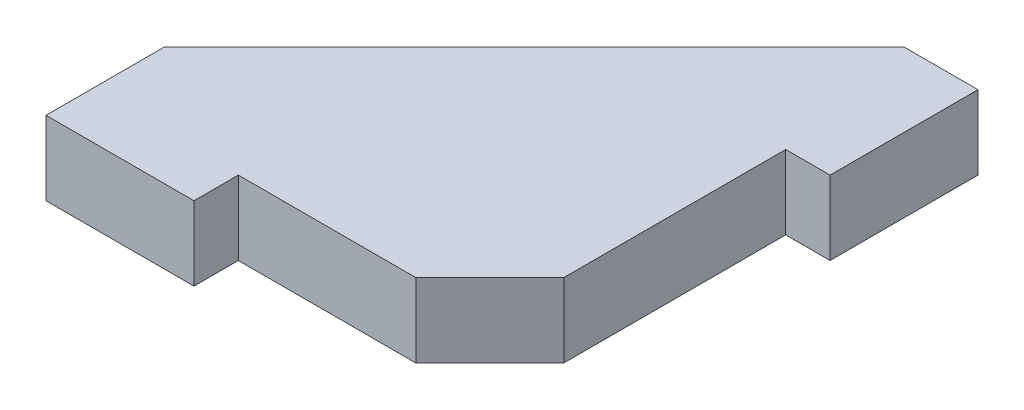
ISO-10303-21;
HEADER;
FILE_DESCRIPTION(('STEP AP214'),'2;1');
FILE_NAME('part.step','',(''),(''),'','','');
FILE_SCHEMA(('AUTOMOTIVE_DESIGN { 1 0 10303 214 1 1 1 1 }'));
ENDSEC;
DATA;
#1=APPLICATION_CONTEXT('core data for automotive mechanical design processes');
#2=APPLICATION_PROTOCOL_DEFINITION('international standard','automotive_design',2000,#1);
#3=PRODUCT_CONTEXT('',#1,'mechanical');
#4=PRODUCT('Part','Part','',(#3));
#5=PRODUCT_RELATED_PRODUCT_CATEGORY('part','',(#4));
#6=PRODUCT_DEFINITION_FORMATION('','',#4);
#7=PRODUCT_DEFINITION_CONTEXT('part definition',#1,'design');
#8=PRODUCT_DEFINITION('design','',#6,#7);
#9=PRODUCT_DEFINITION_SHAPE('','',#8);
#10=(LENGTH_UNIT() NAMED_UNIT(*) SI_UNIT(.MILLI.,.METRE.));
#11=(NAMED_UNIT(*) PLANE_ANGLE_UNIT() SI_UNIT($,.RADIAN.));
#12=(NAMED_UNIT(*) SI_UNIT($,.STERADIAN.) SOLID_ANGLE_UNIT());
#13=UNCERTAINTY_MEASURE_WITH_UNIT(LENGTH_MEASURE(1.E-05),#10,'distance_accuracy_value','');
#14=(GEOMETRIC_REPRESENTATION_CONTEXT(3) GLOBAL_UNCERTAINTY_ASSIGNED_CONTEXT((#13)) GLOBAL_UNIT_ASSIGNED_CONTEXT((#10,
#11,#12)) REPRESENTATION_CONTEXT('',''));
#15=CARTESIAN_POINT('',(0.,0.,0.));
#16=DIRECTION('',(0.,0.,1.));
#17=DIRECTION('',(1.,0.,0.));
#18=AXIS2_PLACEMENT_3D('',#15,#16,#17);
#19=CARTESIAN_POINT('',(10.,5.,0.));
#20=DIRECTION('',(0.,0.,-1.));
#21=DIRECTION('',(-1.,0.,0.));
#22=AXIS2_PLACEMENT_3D('',#19,#20,#21);
#23=PLANE('',#22);
#24=DIRECTION('',(1.,0.,0.));
#25=VECTOR('',#24,1.);
#26=CARTESIAN_POINT('',(10.,0.,0.));
#27=LINE('',#26,#25);
#28=CARTESIAN_POINT('',(0.,0.,0.));
#29=VERTEX_POINT('',#28);
#30=CARTESIAN_POINT('',(10.,0.,0.));
#31=VERTEX_POINT('',#30);
#32=EDGE_CURVE('E140',#29,#31,#27,.T.);
#33=ORIENTED_EDGE('',*,*,#32,.T.);
#34=DIRECTION('',(0.,-1.,0.));
#35=VECTOR('',#34,1.);
#36=CARTESIAN_POINT('',(10.,5.,0.));
#37=LINE('',#36,#35);
#38=CARTESIAN_POINT('',(10.,5.,0.));
#39=VERTEX_POINT('',#38);
#40=EDGE_CURVE('E11',#39,#31,#37,.T.);
#41=ORIENTED_EDGE('',*,*,#40,.F.);
#42=DIRECTION('',(1.,0.,0.));
#43=VECTOR('',#42,1.);
#44=CARTESIAN_POINT('',(10.,5.,0.));
#45=LINE('',#44,#43);
#46=CARTESIAN_POINT('',(0.,5.,0.));
#47=VERTEX_POINT('',#46);
#48=EDGE_CURVE('E158',#47,#39,#45,.T.);
#49=ORIENTED_EDGE('',*,*,#48,.F.);
#50=DIRECTION('',(0.,-1.,0.));
#51=VECTOR('',#50,1.);
#52=CARTESIAN_POINT('',(0.,5.,0.));
#53=LINE('',#52,#51);
#54=EDGE_CURVE('E136',#47,#29,#53,.T.);
#55=ORIENTED_EDGE('',*,*,#54,.T.);
#56=EDGE_LOOP('',(#33,#41,#49,#55));
#57=FACE_BOUND('',#56,.T.);
#58=ADVANCED_FACE('F32',(#57),#23,.F.);
#59=CARTESIAN_POINT('',(10.,5.,-3.));
#60=DIRECTION('',(-1.,0.,0.));
#61=DIRECTION('',(0.,0.,1.));
#62=AXIS2_PLACEMENT_3D('',#59,#60,#61);
#63=PLANE('',#62);
#64=DIRECTION('',(0.,0.,-1.));
#65=VECTOR('',#64,1.);
#66=CARTESIAN_POINT('',(10.,0.,-3.));
#67=LINE('',#66,#65);
#68=CARTESIAN_POINT('',(10.,0.,-3.));
#69=VERTEX_POINT('',#68);
#70=EDGE_CURVE('E143',#31,#69,#67,.T.);
#71=ORIENTED_EDGE('',*,*,#70,.T.);
#72=DIRECTION('',(0.,-1.,0.));
#73=VECTOR('',#72,1.);
#74=CARTESIAN_POINT('',(10.,5.,-3.));
#75=LINE('',#74,#73);
#76=CARTESIAN_POINT('',(10.,5.,-3.));
#77=VERTEX_POINT('',#76);
#78=EDGE_CURVE('E40',#77,#69,#75,.T.);
#79=ORIENTED_EDGE('',*,*,#78,.F.);
#80=DIRECTION('',(0.,0.,-1.));
#81=VECTOR('',#80,1.);
#82=CARTESIAN_POINT('',(10.,5.,-3.));
#83=LINE('',#82,#81);
#84=EDGE_CURVE('E97',#39,#77,#83,.T.);
#85=ORIENTED_EDGE('',*,*,#84,.F.);
#86=ORIENTED_EDGE('',*,*,#40,.T.);
#87=EDGE_LOOP('',(#71,#79,#85,#86));
#88=FACE_BOUND('',#87,.T.);
#89=ADVANCED_FACE('F207',(#88),#63,.F.);
#90=CARTESIAN_POINT('',(22.,5.,-3.));
#91=DIRECTION('',(0.,0.,-1.));
#92=DIRECTION('',(-1.,0.,0.));
#93=AXIS2_PLACEMENT_3D('',#90,#91,#92);
#94=PLANE('',#93);
#95=DIRECTION('',(1.,0.,0.));
#96=VECTOR('',#95,1.);
#97=CARTESIAN_POINT('',(22.,0.,-3.));
#98=LINE('',#97,#96);
#99=CARTESIAN_POINT('',(22.,0.,-3.));
#100=VERTEX_POINT('',#99);
#101=EDGE_CURVE('E145',#69,#100,#98,.T.);
#102=ORIENTED_EDGE('',*,*,#101,.T.);
#103=DIRECTION('',(0.,-1.,0.));
#104=VECTOR('',#103,1.);
#105=CARTESIAN_POINT('',(22.,5.,-3.));
#106=LINE('',#105,#104);
#107=CARTESIAN_POINT('',(22.,5.,-3.));
#108=VERTEX_POINT('',#107);
#109=EDGE_CURVE('E171',#108,#100,#106,.T.);
#110=ORIENTED_EDGE('',*,*,#109,.F.);
#111=DIRECTION('',(1.,0.,0.));
#112=VECTOR('',#111,1.);
#113=CARTESIAN_POINT('',(22.,5.,-3.));
#114=LINE('',#113,#112);
#115=EDGE_CURVE('E179',#77,#108,#114,.T.);
#116=ORIENTED_EDGE('',*,*,#115,.F.);
#117=ORIENTED_EDGE('',*,*,#78,.T.);
#118=EDGE_LOOP('',(#102,#110,#116,#117));
#119=FACE_BOUND('',#118,.T.);
#120=ADVANCED_FACE('F177',(#119),#94,.F.);
#121=CARTESIAN_POINT('',(27.,5.,-8.00000000000002));
#122=DIRECTION('',(-0.707106781186549,0.,-0.707106781186546));
#123=DIRECTION('',(-0.707106781186546,0.,0.707106781186549));
#124=AXIS2_PLACEMENT_3D('',#121,#122,#123);
#125=PLANE('',#124);
#126=DIRECTION('',(0.707106781186546,0.,-0.707106781186549));
#127=VECTOR('',#126,1.);
#128=CARTESIAN_POINT('',(27.,0.,-8.00000000000002));
#129=LINE('',#128,#127);
#130=CARTESIAN_POINT('',(27.,0.,-8.00000000000002));
#131=VERTEX_POINT('',#130);
#132=EDGE_CURVE('E147',#100,#131,#129,.T.);
#133=ORIENTED_EDGE('',*,*,#132,.T.);
#134=DIRECTION('',(0.,-1.,0.));
#135=VECTOR('',#134,1.);
#136=CARTESIAN_POINT('',(27.,5.,-8.00000000000002));
#137=LINE('',#136,#135);
#138=CARTESIAN_POINT('',(27.,5.,-8.00000000000002));
#139=VERTEX_POINT('',#138);
#140=EDGE_CURVE('E168',#139,#131,#137,.T.);
#141=ORIENTED_EDGE('',*,*,#140,.F.);
#142=DIRECTION('',(0.707106781186546,0.,-0.707106781186549));
#143=VECTOR('',#142,1.);
#144=CARTESIAN_POINT('',(27.,5.,-8.00000000000002));
#145=LINE('',#144,#143);
#146=EDGE_CURVE('E197',#108,#139,#145,.T.);
#147=ORIENTED_EDGE('',*,*,#146,.F.);
#148=ORIENTED_EDGE('',*,*,#109,.T.);
#149=EDGE_LOOP('',(#133,#141,#147,#148));
#150=FACE_BOUND('',#149,.T.);
#151=ADVANCED_FACE('F188',(#150),#125,.F.);
#152=CARTESIAN_POINT('',(27.,5.,-23.));
#153=DIRECTION('',(-1.,0.,0.));
#154=DIRECTION('',(0.,0.,1.));
#155=AXIS2_PLACEMENT_3D('',#152,#153,#154);
#156=PLANE('',#155);
#157=DIRECTION('',(0.,0.,-1.));
#158=VECTOR('',#157,1.);
#159=CARTESIAN_POINT('',(27.,0.,-23.));
#160=LINE('',#159,#158);
#161=CARTESIAN_POINT('',(27.,0.,-23.));
#162=VERTEX_POINT('',#161);
#163=EDGE_CURVE('E149',#131,#162,#160,.T.);
#164=ORIENTED_EDGE('',*,*,#163,.T.);
#165=DIRECTION('',(0.,-1.,0.));
#166=VECTOR('',#165,1.);
#167=CARTESIAN_POINT('',(27.,5.,-23.));
#168=LINE('',#167,#166);
#169=CARTESIAN_POINT('',(27.,5.,-23.));
#170=VERTEX_POINT('',#169);
#171=EDGE_CURVE('E165',#170,#162,#168,.T.);
#172=ORIENTED_EDGE('',*,*,#171,.F.);
#173=DIRECTION('',(0.,0.,-1.));
#174=VECTOR('',#173,1.);
#175=CARTESIAN_POINT('',(27.,5.,-23.));
#176=LINE('',#175,#174);
#177=EDGE_CURVE('E194',#139,#170,#176,.T.);
#178=ORIENTED_EDGE('',*,*,#177,.F.);
#179=ORIENTED_EDGE('',*,*,#140,.T.);
#180=EDGE_LOOP('',(#164,#172,#178,#179));
#181=FACE_BOUND('',#180,.T.);
#182=ADVANCED_FACE('F192',(#181),#156,.F.);
#183=CARTESIAN_POINT('',(30.,5.,-23.));
#184=DIRECTION('',(0.,0.,-1.));
#185=DIRECTION('',(-1.,0.,0.));
#186=AXIS2_PLACEMENT_3D('',#183,#184,#185);
#187=PLANE('',#186);
#188=DIRECTION('',(1.,0.,0.));
#189=VECTOR('',#188,1.);
#190=CARTESIAN_POINT('',(30.,0.,-23.));
#191=LINE('',#190,#189);
#192=CARTESIAN_POINT('',(30.,0.,-23.));
#193=VERTEX_POINT('',#192);
#194=EDGE_CURVE('E151',#162,#193,#191,.T.);
#195=ORIENTED_EDGE('',*,*,#194,.T.);
#196=DIRECTION('',(0.,-1.,0.));
#197=VECTOR('',#196,1.);
#198=CARTESIAN_POINT('',(30.,5.,-23.));
#199=LINE('',#198,#197);
#200=CARTESIAN_POINT('',(30.,5.,-23.));
#201=VERTEX_POINT('',#200);
#202=EDGE_CURVE('E162',#201,#193,#199,.T.);
#203=ORIENTED_EDGE('',*,*,#202,.F.);
#204=DIRECTION('',(1.,0.,0.));
#205=VECTOR('',#204,1.);
#206=CARTESIAN_POINT('',(30.,5.,-23.));
#207=LINE('',#206,#205);
#208=EDGE_CURVE('E196',#170,#201,#207,.T.);
#209=ORIENTED_EDGE('',*,*,#208,.F.);
#210=ORIENTED_EDGE('',*,*,#171,.T.);
#211=EDGE_LOOP('',(#195,#203,#209,#210));
#212=FACE_BOUND('',#211,.T.);
#213=ADVANCED_FACE('F219',(#212),#187,.F.);
#214=CARTESIAN_POINT('',(30.,5.,-33.));
#215=DIRECTION('',(-1.,0.,0.));
#216=DIRECTION('',(0.,0.,1.));
#217=AXIS2_PLACEMENT_3D('',#214,#215,#216);
#218=PLANE('',#217);
#219=DIRECTION('',(0.,0.,-1.));
#220=VECTOR('',#219,1.);
#221=CARTESIAN_POINT('',(30.,0.,-33.));
#222=LINE('',#221,#220);
#223=CARTESIAN_POINT('',(30.,0.,-33.));
#224=VERTEX_POINT('',#223);
#225=EDGE_CURVE('E153',#193,#224,#222,.T.);
#226=ORIENTED_EDGE('',*,*,#225,.T.);
#227=DIRECTION('',(0.,-1.,0.));
#228=VECTOR('',#227,1.);
#229=CARTESIAN_POINT('',(30.,5.,-33.));
#230=LINE('',#229,#228);
#231=CARTESIAN_POINT('',(30.,5.,-33.));
#232=VERTEX_POINT('',#231);
#233=EDGE_CURVE('E131',#232,#224,#230,.T.);
#234=ORIENTED_EDGE('',*,*,#233,.F.);
#235=DIRECTION('',(0.,0.,-1.));
#236=VECTOR('',#235,1.);
#237=CARTESIAN_POINT('',(30.,5.,-33.));
#238=LINE('',#237,#236);
#239=EDGE_CURVE('E122',#201,#232,#238,.T.);
#240=ORIENTED_EDGE('',*,*,#239,.F.);
#241=ORIENTED_EDGE('',*,*,#202,.T.);
#242=EDGE_LOOP('',(#226,#234,#240,#241));
#243=FACE_BOUND('',#242,.T.);
#244=ADVANCED_FACE('F222',(#243),#218,.F.);
#245=CARTESIAN_POINT('',(24.9999999999999,5.,-33.));
#246=DIRECTION('',(0.,0.,1.));
#247=DIRECTION('',(1.,0.,0.));
#248=AXIS2_PLACEMENT_3D('',#245,#246,#247);
#249=PLANE('',#248);
#250=DIRECTION('',(-1.,0.,0.));
#251=VECTOR('',#250,1.);
#252=CARTESIAN_POINT('',(24.9999999999999,0.,-33.));
#253=LINE('',#252,#251);
#254=CARTESIAN_POINT('',(24.9999999999999,0.,-33.));
#255=VERTEX_POINT('',#254);
#256=EDGE_CURVE('E130',#224,#255,#253,.T.);
#257=ORIENTED_EDGE('',*,*,#256,.T.);
#258=DIRECTION('',(0.,-1.,0.));
#259=VECTOR('',#258,1.);
#260=CARTESIAN_POINT('',(24.9999999999999,5.,-33.));
#261=LINE('',#260,#259);
#262=CARTESIAN_POINT('',(24.9999999999999,5.,-33.));
#263=VERTEX_POINT('',#262);
#264=EDGE_CURVE('E127',#263,#255,#261,.T.);
#265=ORIENTED_EDGE('',*,*,#264,.F.);
#266=DIRECTION('',(-1.,0.,0.));
#267=VECTOR('',#266,1.);
#268=CARTESIAN_POINT('',(24.9999999999999,5.,-33.));
#269=LINE('',#268,#267);
#270=EDGE_CURVE('E116',#232,#263,#269,.T.);
#271=ORIENTED_EDGE('',*,*,#270,.F.);
#272=ORIENTED_EDGE('',*,*,#233,.T.);
#273=EDGE_LOOP('',(#257,#265,#271,#272));
#274=FACE_BOUND('',#273,.T.);
#275=ADVANCED_FACE('F128',(#274),#249,.F.);
#276=CARTESIAN_POINT('',(0.,5.,-8.));
#277=DIRECTION('',(0.707106781186549,0.,0.707106781186546));
#278=DIRECTION('',(0.707106781186546,0.,-0.707106781186549));
#279=AXIS2_PLACEMENT_3D('',#276,#277,#278);
#280=PLANE('',#279);
#281=DIRECTION('',(-0.707106781186546,0.,0.707106781186549));
#282=VECTOR('',#281,1.);
#283=CARTESIAN_POINT('',(0.,0.,-8.));
#284=LINE('',#283,#282);
#285=CARTESIAN_POINT('',(0.,0.,-8.));
#286=VERTEX_POINT('',#285);
#287=EDGE_CURVE('E83',#255,#286,#284,.T.);
#288=ORIENTED_EDGE('',*,*,#287,.T.);
#289=DIRECTION('',(0.,-1.,0.));
#290=VECTOR('',#289,1.);
#291=CARTESIAN_POINT('',(0.,5.,-8.));
#292=LINE('',#291,#290);
#293=CARTESIAN_POINT('',(0.,5.,-8.));
#294=VERTEX_POINT('',#293);
#295=EDGE_CURVE('E132',#294,#286,#292,.T.);
#296=ORIENTED_EDGE('',*,*,#295,.F.);
#297=DIRECTION('',(-0.707106781186546,0.,0.707106781186549));
#298=VECTOR('',#297,1.);
#299=CARTESIAN_POINT('',(0.,5.,-8.));
#300=LINE('',#299,#298);
#301=EDGE_CURVE('E120',#263,#294,#300,.T.);
#302=ORIENTED_EDGE('',*,*,#301,.F.);
#303=ORIENTED_EDGE('',*,*,#264,.T.);
#304=EDGE_LOOP('',(#288,#296,#302,#303));
#305=FACE_BOUND('',#304,.T.);
#306=ADVANCED_FACE('F134',(#305),#280,.F.);
#307=CARTESIAN_POINT('',(0.,5.,0.));
#308=DIRECTION('',(1.,0.,0.));
#309=DIRECTION('',(0.,0.,-1.));
#310=AXIS2_PLACEMENT_3D('',#307,#308,#309);
#311=PLANE('',#310);
#312=DIRECTION('',(0.,0.,1.));
#313=VECTOR('',#312,1.);
#314=CARTESIAN_POINT('',(0.,0.,0.));
#315=LINE('',#314,#313);
#316=EDGE_CURVE('E89',#286,#29,#315,.T.);
#317=ORIENTED_EDGE('',*,*,#316,.T.);
#318=ORIENTED_EDGE('',*,*,#54,.F.);
#319=DIRECTION('',(0.,0.,1.));
#320=VECTOR('',#319,1.);
#321=CARTESIAN_POINT('',(0.,5.,0.));
#322=LINE('',#321,#320);
#323=EDGE_CURVE('E48',#294,#47,#322,.T.);
#324=ORIENTED_EDGE('',*,*,#323,.F.);
#325=ORIENTED_EDGE('',*,*,#295,.T.);
#326=EDGE_LOOP('',(#317,#318,#324,#325));
#327=FACE_BOUND('',#326,.T.);
#328=ADVANCED_FACE('F231',(#327),#311,.F.);
#329=CARTESIAN_POINT('',(0.,5.,0.));
#330=DIRECTION('',(0.,-1.,0.));
#331=DIRECTION('',(0.,0.,-1.));
#332=AXIS2_PLACEMENT_3D('',#329,#330,#331);
#333=PLANE('',#332);
#334=ORIENTED_EDGE('',*,*,#48,.T.);
#335=ORIENTED_EDGE('',*,*,#84,.T.);
#336=ORIENTED_EDGE('',*,*,#115,.T.);
#337=ORIENTED_EDGE('',*,*,#146,.T.);
#338=ORIENTED_EDGE('',*,*,#177,.T.);
#339=ORIENTED_EDGE('',*,*,#208,.T.);
#340=ORIENTED_EDGE('',*,*,#239,.T.);
#341=ORIENTED_EDGE('',*,*,#270,.T.);
#342=ORIENTED_EDGE('',*,*,#301,.T.);
#343=ORIENTED_EDGE('',*,*,#323,.T.);
#344=EDGE_LOOP('',(#334,#335,#336,#337,#338,#339,#340,#341,#342,#343));
#345=FACE_BOUND('',#344,.T.);
#346=ADVANCED_FACE('F118',(#345),#333,.F.);
#347=CARTESIAN_POINT('',(0.,0.,0.));
#348=DIRECTION('',(0.,-1.,0.));
#349=DIRECTION('',(0.,0.,-1.));
#350=AXIS2_PLACEMENT_3D('',#347,#348,#349);
#351=PLANE('',#350);
#352=ORIENTED_EDGE('',*,*,#32,.F.);
#353=ORIENTED_EDGE('',*,*,#316,.F.);
#354=ORIENTED_EDGE('',*,*,#287,.F.);
#355=ORIENTED_EDGE('',*,*,#256,.F.);
#356=ORIENTED_EDGE('',*,*,#225,.F.);
#357=ORIENTED_EDGE('',*,*,#194,.F.);
#358=ORIENTED_EDGE('',*,*,#163,.F.);
#359=ORIENTED_EDGE('',*,*,#132,.F.);
#360=ORIENTED_EDGE('',*,*,#101,.F.);
#361=ORIENTED_EDGE('',*,*,#70,.F.);
#362=EDGE_LOOP('',(#352,#353,#354,#355,#356,#357,#358,#359,#360,#361));
#363=FACE_BOUND('',#362,.T.);
#364=ADVANCED_FACE('F183',(#363),#351,.T.);
#365=CLOSED_SHELL('',(#58,#89,#120,#151,#182,#213,#244,#275,#306,#328,#346,#364));
#366=MANIFOLD_SOLID_BREP('B2',#365);
#367=ADVANCED_BREP_SHAPE_REPRESENTATION('',(#18,#366),#14);
#368=SHAPE_DEFINITION_REPRESENTATION(#9,#367);
ENDSEC;
END-ISO-10303-21;
